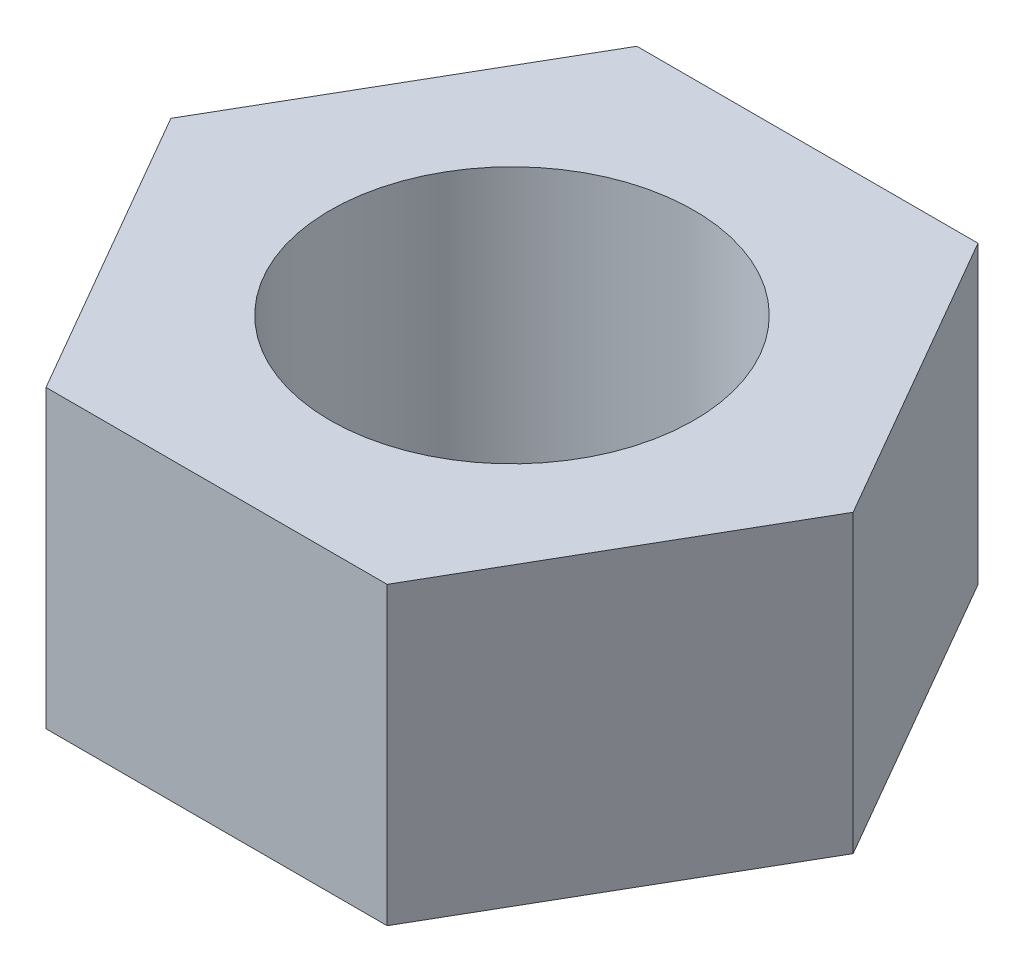
ISO-10303-21;
HEADER;
FILE_DESCRIPTION(('STEP AP214'),'2;1');
FILE_NAME('part.step','',(''),(''),'','','');
FILE_SCHEMA(('AUTOMOTIVE_DESIGN { 1 0 10303 214 1 1 1 1 }'));
ENDSEC;
DATA;
#1=APPLICATION_CONTEXT('core data for automotive mechanical design processes');
#2=APPLICATION_PROTOCOL_DEFINITION('international standard','automotive_design',2000,#1);
#3=PRODUCT_CONTEXT('',#1,'mechanical');
#4=PRODUCT('Part','Part','',(#3));
#5=PRODUCT_RELATED_PRODUCT_CATEGORY('part','',(#4));
#6=PRODUCT_DEFINITION_FORMATION('','',#4);
#7=PRODUCT_DEFINITION_CONTEXT('part definition',#1,'design');
#8=PRODUCT_DEFINITION('design','',#6,#7);
#9=PRODUCT_DEFINITION_SHAPE('','',#8);
#10=(LENGTH_UNIT() NAMED_UNIT(*) SI_UNIT(.MILLI.,.METRE.));
#11=(NAMED_UNIT(*) PLANE_ANGLE_UNIT() SI_UNIT($,.RADIAN.));
#12=(NAMED_UNIT(*) SI_UNIT($,.STERADIAN.) SOLID_ANGLE_UNIT());
#13=UNCERTAINTY_MEASURE_WITH_UNIT(LENGTH_MEASURE(1.E-05),#10,'distance_accuracy_value','');
#14=(GEOMETRIC_REPRESENTATION_CONTEXT(3) GLOBAL_UNCERTAINTY_ASSIGNED_CONTEXT((#13)) GLOBAL_UNIT_ASSIGNED_CONTEXT((#10,
#11,#12)) REPRESENTATION_CONTEXT('',''));
#15=CARTESIAN_POINT('',(0.,0.,0.));
#16=DIRECTION('',(0.,0.,1.));
#17=DIRECTION('',(1.,0.,0.));
#18=AXIS2_PLACEMENT_3D('',#15,#16,#17);
#19=CARTESIAN_POINT('',(3.74999999999999,6.5,6.49519052838329));
#20=DIRECTION('',(0.,1.,0.));
#21=DIRECTION('',(0.,0.,1.));
#22=AXIS2_PLACEMENT_3D('',#19,#20,#21);
#23=PLANE('',#22);
#24=DIRECTION('',(1.,0.,0.));
#25=VECTOR('',#24,1.);
#26=CARTESIAN_POINT('',(-3.75,6.5,6.49519052838329));
#27=LINE('',#26,#25);
#28=CARTESIAN_POINT('',(-3.75,6.5,6.49519052838329));
#29=VERTEX_POINT('',#28);
#30=CARTESIAN_POINT('',(3.74999999999999,6.5,6.49519052838329));
#31=VERTEX_POINT('',#30);
#32=EDGE_CURVE('E128',#29,#31,#27,.T.);
#33=ORIENTED_EDGE('',*,*,#32,.T.);
#34=DIRECTION('',(0.5,0.,-0.866025403784439));
#35=VECTOR('',#34,1.);
#36=CARTESIAN_POINT('',(3.74999999999999,6.5,6.49519052838329));
#37=LINE('',#36,#35);
#38=CARTESIAN_POINT('',(7.5,6.5,0.));
#39=VERTEX_POINT('',#38);
#40=EDGE_CURVE('E86',#31,#39,#37,.T.);
#41=ORIENTED_EDGE('',*,*,#40,.T.);
#42=DIRECTION('',(-0.5,0.,-0.866025403784439));
#43=VECTOR('',#42,1.);
#44=CARTESIAN_POINT('',(7.5,6.5,0.));
#45=LINE('',#44,#43);
#46=CARTESIAN_POINT('',(3.75,6.5,-6.49519052838329));
#47=VERTEX_POINT('',#46);
#48=EDGE_CURVE('E99',#39,#47,#45,.T.);
#49=ORIENTED_EDGE('',*,*,#48,.T.);
#50=DIRECTION('',(-1.,0.,0.));
#51=VECTOR('',#50,1.);
#52=CARTESIAN_POINT('',(3.75,6.5,-6.49519052838329));
#53=LINE('',#52,#51);
#54=CARTESIAN_POINT('',(-3.75,6.5,-6.49519052838329));
#55=VERTEX_POINT('',#54);
#56=EDGE_CURVE('E93',#47,#55,#53,.T.);
#57=ORIENTED_EDGE('',*,*,#56,.T.);
#58=DIRECTION('',(-0.5,0.,0.866025403784438));
#59=VECTOR('',#58,1.);
#60=CARTESIAN_POINT('',(-3.75,6.5,-6.49519052838329));
#61=LINE('',#60,#59);
#62=CARTESIAN_POINT('',(-7.50000000000001,6.5,0.));
#63=VERTEX_POINT('',#62);
#64=EDGE_CURVE('E97',#55,#63,#61,.T.);
#65=ORIENTED_EDGE('',*,*,#64,.T.);
#66=DIRECTION('',(0.5,0.,0.866025403784438));
#67=VECTOR('',#66,1.);
#68=CARTESIAN_POINT('',(-7.50000000000001,6.5,0.));
#69=LINE('',#68,#67);
#70=EDGE_CURVE('E49',#63,#29,#69,.T.);
#71=ORIENTED_EDGE('',*,*,#70,.T.);
#72=EDGE_LOOP('',(#33,#41,#49,#57,#65,#71));
#73=FACE_BOUND('',#72,.T.);
#74=CARTESIAN_POINT('',(0.,6.5,0.));
#75=DIRECTION('',(0.,1.,0.));
#76=DIRECTION('',(0.,0.,1.));
#77=AXIS2_PLACEMENT_3D('',#74,#75,#76);
#78=CIRCLE('',#77,4.);
#79=CARTESIAN_POINT('',(0.,6.5,4.));
#80=VERTEX_POINT('',#79);
#81=EDGE_CURVE('E121',#80,#80,#78,.T.);
#82=ORIENTED_EDGE('',*,*,#81,.F.);
#83=EDGE_LOOP('',(#82));
#84=FACE_BOUND('',#83,.T.);
#85=ADVANCED_FACE('F32',(#73,#84),#23,.T.);
#86=CARTESIAN_POINT('',(3.74999999999999,0.,6.49519052838329));
#87=DIRECTION('',(0.,1.,0.));
#88=DIRECTION('',(0.,0.,1.));
#89=AXIS2_PLACEMENT_3D('',#86,#87,#88);
#90=PLANE('',#89);
#91=DIRECTION('',(1.,0.,0.));
#92=VECTOR('',#91,1.);
#93=CARTESIAN_POINT('',(-3.75,0.,6.49519052838329));
#94=LINE('',#93,#92);
#95=CARTESIAN_POINT('',(-3.75,0.,6.49519052838329));
#96=VERTEX_POINT('',#95);
#97=CARTESIAN_POINT('',(3.74999999999999,0.,6.49519052838329));
#98=VERTEX_POINT('',#97);
#99=EDGE_CURVE('E117',#96,#98,#94,.T.);
#100=ORIENTED_EDGE('',*,*,#99,.F.);
#101=DIRECTION('',(0.5,0.,0.866025403784438));
#102=VECTOR('',#101,1.);
#103=CARTESIAN_POINT('',(-7.50000000000001,0.,0.));
#104=LINE('',#103,#102);
#105=CARTESIAN_POINT('',(-7.50000000000001,0.,0.));
#106=VERTEX_POINT('',#105);
#107=EDGE_CURVE('E78',#106,#96,#104,.T.);
#108=ORIENTED_EDGE('',*,*,#107,.F.);
#109=DIRECTION('',(-0.5,0.,0.866025403784438));
#110=VECTOR('',#109,1.);
#111=CARTESIAN_POINT('',(-3.75,0.,-6.49519052838329));
#112=LINE('',#111,#110);
#113=CARTESIAN_POINT('',(-3.75,0.,-6.49519052838329));
#114=VERTEX_POINT('',#113);
#115=EDGE_CURVE('E72',#114,#106,#112,.T.);
#116=ORIENTED_EDGE('',*,*,#115,.F.);
#117=DIRECTION('',(-1.,0.,0.));
#118=VECTOR('',#117,1.);
#119=CARTESIAN_POINT('',(3.75,0.,-6.49519052838329));
#120=LINE('',#119,#118);
#121=CARTESIAN_POINT('',(3.75,0.,-6.49519052838329));
#122=VERTEX_POINT('',#121);
#123=EDGE_CURVE('E107',#122,#114,#120,.T.);
#124=ORIENTED_EDGE('',*,*,#123,.F.);
#125=DIRECTION('',(-0.5,0.,-0.866025403784439));
#126=VECTOR('',#125,1.);
#127=CARTESIAN_POINT('',(7.5,0.,0.));
#128=LINE('',#127,#126);
#129=CARTESIAN_POINT('',(7.5,0.,0.));
#130=VERTEX_POINT('',#129);
#131=EDGE_CURVE('E123',#130,#122,#128,.T.);
#132=ORIENTED_EDGE('',*,*,#131,.F.);
#133=DIRECTION('',(0.5,0.,-0.866025403784439));
#134=VECTOR('',#133,1.);
#135=CARTESIAN_POINT('',(3.74999999999999,0.,6.49519052838329));
#136=LINE('',#135,#134);
#137=EDGE_CURVE('E120',#98,#130,#136,.T.);
#138=ORIENTED_EDGE('',*,*,#137,.F.);
#139=EDGE_LOOP('',(#100,#108,#116,#124,#132,#138));
#140=FACE_BOUND('',#139,.T.);
#141=CARTESIAN_POINT('',(0.,0.,0.));
#142=DIRECTION('',(0.,1.,0.));
#143=DIRECTION('',(0.,0.,1.));
#144=AXIS2_PLACEMENT_3D('',#141,#142,#143);
#145=CIRCLE('',#144,4.);
#146=CARTESIAN_POINT('',(0.,0.,4.));
#147=VERTEX_POINT('',#146);
#148=EDGE_CURVE('E221',#147,#147,#145,.T.);
#149=ORIENTED_EDGE('',*,*,#148,.T.);
#150=EDGE_LOOP('',(#149));
#151=FACE_BOUND('',#150,.T.);
#152=ADVANCED_FACE('F137',(#140,#151),#90,.F.);
#153=CARTESIAN_POINT('',(-3.75,6.5,6.49519052838329));
#154=DIRECTION('',(0.,0.,-1.));
#155=DIRECTION('',(-1.,0.,0.));
#156=AXIS2_PLACEMENT_3D('',#153,#154,#155);
#157=PLANE('',#156);
#158=ORIENTED_EDGE('',*,*,#99,.T.);
#159=DIRECTION('',(0.,-1.,0.));
#160=VECTOR('',#159,1.);
#161=CARTESIAN_POINT('',(3.74999999999999,6.5,6.49519052838329));
#162=LINE('',#161,#160);
#163=EDGE_CURVE('E11',#31,#98,#162,.T.);
#164=ORIENTED_EDGE('',*,*,#163,.F.);
#165=ORIENTED_EDGE('',*,*,#32,.F.);
#166=DIRECTION('',(0.,-1.,0.));
#167=VECTOR('',#166,1.);
#168=CARTESIAN_POINT('',(-3.75,6.5,6.49519052838329));
#169=LINE('',#168,#167);
#170=EDGE_CURVE('E113',#29,#96,#169,.T.);
#171=ORIENTED_EDGE('',*,*,#170,.T.);
#172=EDGE_LOOP('',(#158,#164,#165,#171));
#173=FACE_BOUND('',#172,.T.);
#174=ADVANCED_FACE('F34',(#173),#157,.F.);
#175=CARTESIAN_POINT('',(3.74999999999999,6.5,6.49519052838329));
#176=DIRECTION('',(-0.866025403784439,0.,-0.5));
#177=DIRECTION('',(-0.5,0.,0.866025403784439));
#178=AXIS2_PLACEMENT_3D('',#175,#176,#177);
#179=PLANE('',#178);
#180=ORIENTED_EDGE('',*,*,#137,.T.);
#181=DIRECTION('',(0.,-1.,0.));
#182=VECTOR('',#181,1.);
#183=CARTESIAN_POINT('',(7.5,6.5,0.));
#184=LINE('',#183,#182);
#185=EDGE_CURVE('E41',#39,#130,#184,.T.);
#186=ORIENTED_EDGE('',*,*,#185,.F.);
#187=ORIENTED_EDGE('',*,*,#40,.F.);
#188=ORIENTED_EDGE('',*,*,#163,.T.);
#189=EDGE_LOOP('',(#180,#186,#187,#188));
#190=FACE_BOUND('',#189,.T.);
#191=ADVANCED_FACE('F162',(#190),#179,.F.);
#192=CARTESIAN_POINT('',(7.5,6.5,0.));
#193=DIRECTION('',(-0.866025403784438,0.,0.5));
#194=DIRECTION('',(0.5,0.,0.866025403784439));
#195=AXIS2_PLACEMENT_3D('',#192,#193,#194);
#196=PLANE('',#195);
#197=ORIENTED_EDGE('',*,*,#131,.T.);
#198=DIRECTION('',(0.,-1.,0.));
#199=VECTOR('',#198,1.);
#200=CARTESIAN_POINT('',(3.75,6.5,-6.49519052838329));
#201=LINE('',#200,#199);
#202=EDGE_CURVE('E108',#47,#122,#201,.T.);
#203=ORIENTED_EDGE('',*,*,#202,.F.);
#204=ORIENTED_EDGE('',*,*,#48,.F.);
#205=ORIENTED_EDGE('',*,*,#185,.T.);
#206=EDGE_LOOP('',(#197,#203,#204,#205));
#207=FACE_BOUND('',#206,.T.);
#208=ADVANCED_FACE('F134',(#207),#196,.F.);
#209=CARTESIAN_POINT('',(3.75,6.5,-6.49519052838329));
#210=DIRECTION('',(0.,0.,1.));
#211=DIRECTION('',(1.,0.,0.));
#212=AXIS2_PLACEMENT_3D('',#209,#210,#211);
#213=PLANE('',#212);
#214=ORIENTED_EDGE('',*,*,#123,.T.);
#215=DIRECTION('',(0.,-1.,0.));
#216=VECTOR('',#215,1.);
#217=CARTESIAN_POINT('',(-3.75,6.5,-6.49519052838329));
#218=LINE('',#217,#216);
#219=EDGE_CURVE('E104',#55,#114,#218,.T.);
#220=ORIENTED_EDGE('',*,*,#219,.F.);
#221=ORIENTED_EDGE('',*,*,#56,.F.);
#222=ORIENTED_EDGE('',*,*,#202,.T.);
#223=EDGE_LOOP('',(#214,#220,#221,#222));
#224=FACE_BOUND('',#223,.T.);
#225=ADVANCED_FACE('F105',(#224),#213,.F.);
#226=CARTESIAN_POINT('',(-3.75,6.5,-6.49519052838329));
#227=DIRECTION('',(0.866025403784438,0.,0.5));
#228=DIRECTION('',(0.5,0.,-0.866025403784439));
#229=AXIS2_PLACEMENT_3D('',#226,#227,#228);
#230=PLANE('',#229);
#231=ORIENTED_EDGE('',*,*,#115,.T.);
#232=DIRECTION('',(0.,-1.,0.));
#233=VECTOR('',#232,1.);
#234=CARTESIAN_POINT('',(-7.50000000000001,6.5,0.));
#235=LINE('',#234,#233);
#236=EDGE_CURVE('E109',#63,#106,#235,.T.);
#237=ORIENTED_EDGE('',*,*,#236,.F.);
#238=ORIENTED_EDGE('',*,*,#64,.F.);
#239=ORIENTED_EDGE('',*,*,#219,.T.);
#240=EDGE_LOOP('',(#231,#237,#238,#239));
#241=FACE_BOUND('',#240,.T.);
#242=ADVANCED_FACE('F111',(#241),#230,.F.);
#243=CARTESIAN_POINT('',(-7.50000000000001,6.5,0.));
#244=DIRECTION('',(0.866025403784438,0.,-0.5));
#245=DIRECTION('',(-0.5,0.,-0.866025403784439));
#246=AXIS2_PLACEMENT_3D('',#243,#244,#245);
#247=PLANE('',#246);
#248=ORIENTED_EDGE('',*,*,#107,.T.);
#249=ORIENTED_EDGE('',*,*,#170,.F.);
#250=ORIENTED_EDGE('',*,*,#70,.F.);
#251=ORIENTED_EDGE('',*,*,#236,.T.);
#252=EDGE_LOOP('',(#248,#249,#250,#251));
#253=FACE_BOUND('',#252,.T.);
#254=ADVANCED_FACE('F142',(#253),#247,.F.);
#255=CARTESIAN_POINT('',(0.,6.5,0.));
#256=DIRECTION('',(0.,-1.,0.));
#257=DIRECTION('',(0.,0.,-1.));
#258=AXIS2_PLACEMENT_3D('',#255,#256,#257);
#259=CYLINDRICAL_SURFACE('',#258,4.);
#260=ORIENTED_EDGE('',*,*,#81,.T.);
#261=EDGE_LOOP('',(#260));
#262=FACE_BOUND('',#261,.T.);
#263=ORIENTED_EDGE('',*,*,#148,.F.);
#264=EDGE_LOOP('',(#263));
#265=FACE_BOUND('',#264,.T.);
#266=ADVANCED_FACE('F144',(#262,#265),#259,.F.);
#267=CLOSED_SHELL('',(#85,#152,#174,#191,#208,#225,#242,#254,#266));
#268=MANIFOLD_SOLID_BREP('B2',#267);
#269=ADVANCED_BREP_SHAPE_REPRESENTATION('',(#18,#268),#14);
#270=SHAPE_DEFINITION_REPRESENTATION(#9,#269);
ENDSEC;
END-ISO-10303-21;
